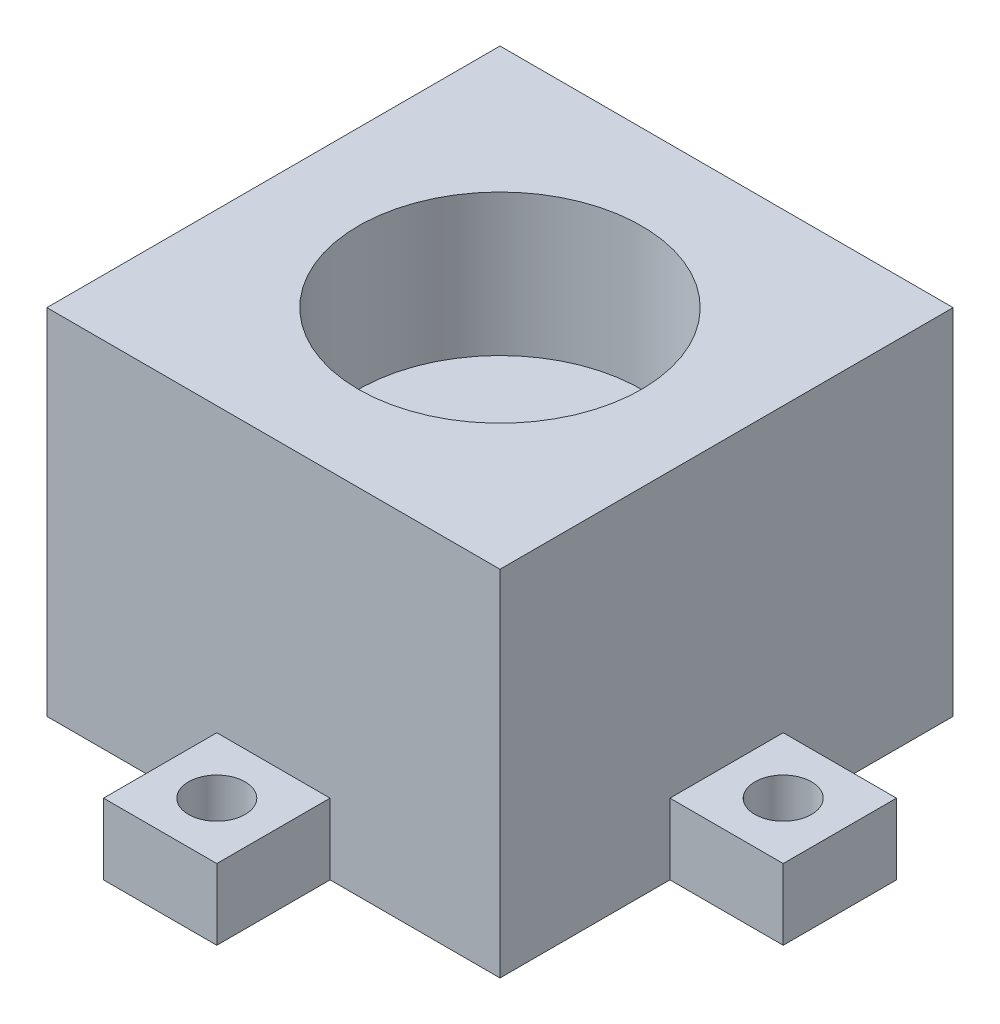
ISO-10303-21;
HEADER;
FILE_DESCRIPTION(('STEP AP214'),'2;1');
FILE_NAME('part.step','',(''),(''),'','','');
FILE_SCHEMA(('AUTOMOTIVE_DESIGN { 1 0 10303 214 1 1 1 1 }'));
ENDSEC;
DATA;
#1=APPLICATION_CONTEXT('core data for automotive mechanical design processes');
#2=APPLICATION_PROTOCOL_DEFINITION('international standard','automotive_design',2000,#1);
#3=PRODUCT_CONTEXT('',#1,'mechanical');
#4=PRODUCT('Part','Part','',(#3));
#5=PRODUCT_RELATED_PRODUCT_CATEGORY('part','',(#4));
#6=PRODUCT_DEFINITION_FORMATION('','',#4);
#7=PRODUCT_DEFINITION_CONTEXT('part definition',#1,'design');
#8=PRODUCT_DEFINITION('design','',#6,#7);
#9=PRODUCT_DEFINITION_SHAPE('','',#8);
#10=(LENGTH_UNIT() NAMED_UNIT(*) SI_UNIT(.MILLI.,.METRE.));
#11=(NAMED_UNIT(*) PLANE_ANGLE_UNIT() SI_UNIT($,.RADIAN.));
#12=(NAMED_UNIT(*) SI_UNIT($,.STERADIAN.) SOLID_ANGLE_UNIT());
#13=UNCERTAINTY_MEASURE_WITH_UNIT(LENGTH_MEASURE(1.E-05),#10,'distance_accuracy_value','');
#14=(GEOMETRIC_REPRESENTATION_CONTEXT(3) GLOBAL_UNCERTAINTY_ASSIGNED_CONTEXT((#13)) GLOBAL_UNIT_ASSIGNED_CONTEXT((#10,
#11,#12)) REPRESENTATION_CONTEXT('',''));
#15=CARTESIAN_POINT('',(0.,0.,0.));
#16=DIRECTION('',(0.,0.,1.));
#17=DIRECTION('',(1.,0.,0.));
#18=AXIS2_PLACEMENT_3D('',#15,#16,#17);
#19=CARTESIAN_POINT('',(0.,6.35,0.));
#20=DIRECTION('',(0.,1.,0.));
#21=DIRECTION('',(0.,0.,1.));
#22=AXIS2_PLACEMENT_3D('',#19,#20,#21);
#23=PLANE('',#22);
#24=DIRECTION('',(0.,0.,1.));
#25=VECTOR('',#24,1.);
#26=CARTESIAN_POINT('',(0.,6.35,-40.64));
#27=LINE('',#26,#25);
#28=CARTESIAN_POINT('',(0.,6.35,-25.4));
#29=VERTEX_POINT('',#28);
#30=CARTESIAN_POINT('',(0.,6.35,-15.24));
#31=VERTEX_POINT('',#30);
#32=EDGE_CURVE('E11',#29,#31,#27,.T.);
#33=ORIENTED_EDGE('',*,*,#32,.F.);
#34=DIRECTION('',(1.,0.,0.));
#35=VECTOR('',#34,1.);
#36=CARTESIAN_POINT('',(0.,6.35,-25.4));
#37=LINE('',#36,#35);
#38=CARTESIAN_POINT('',(-10.16,6.35,-25.4));
#39=VERTEX_POINT('',#38);
#40=EDGE_CURVE('E183',#39,#29,#37,.T.);
#41=ORIENTED_EDGE('',*,*,#40,.F.);
#42=DIRECTION('',(0.,0.,1.));
#43=VECTOR('',#42,1.);
#44=CARTESIAN_POINT('',(-10.16,6.35,0.));
#45=LINE('',#44,#43);
#46=CARTESIAN_POINT('',(-10.16,6.35,-15.24));
#47=VERTEX_POINT('',#46);
#48=EDGE_CURVE('E221',#39,#47,#45,.T.);
#49=ORIENTED_EDGE('',*,*,#48,.T.);
#50=DIRECTION('',(1.,0.,0.));
#51=VECTOR('',#50,1.);
#52=CARTESIAN_POINT('',(0.,6.35,-15.24));
#53=LINE('',#52,#51);
#54=EDGE_CURVE('E131',#47,#31,#53,.T.);
#55=ORIENTED_EDGE('',*,*,#54,.T.);
#56=EDGE_LOOP('',(#33,#41,#49,#55));
#57=FACE_BOUND('',#56,.T.);
#58=CARTESIAN_POINT('',(-5.08,6.35,-20.32));
#59=DIRECTION('',(0.,1.,0.));
#60=DIRECTION('',(0.,0.,1.));
#61=AXIS2_PLACEMENT_3D('',#58,#59,#60);
#62=CIRCLE('',#61,2.54);
#63=CARTESIAN_POINT('',(-5.08,6.35,-17.78));
#64=VERTEX_POINT('',#63);
#65=EDGE_CURVE('E207',#64,#64,#62,.T.);
#66=ORIENTED_EDGE('',*,*,#65,.F.);
#67=EDGE_LOOP('',(#66));
#68=FACE_BOUND('',#67,.T.);
#69=ADVANCED_FACE('F35',(#57,#68),#23,.T.);
#70=DIRECTION('',(-1.,0.,0.));
#71=VECTOR('',#70,1.);
#72=CARTESIAN_POINT('',(0.,6.35,-40.64));
#73=LINE('',#72,#71);
#74=CARTESIAN_POINT('',(25.4,6.35,-40.64));
#75=VERTEX_POINT('',#74);
#76=CARTESIAN_POINT('',(15.24,6.35,-40.64));
#77=VERTEX_POINT('',#76);
#78=EDGE_CURVE('E45',#75,#77,#73,.T.);
#79=ORIENTED_EDGE('',*,*,#78,.F.);
#80=DIRECTION('',(0.,0.,1.));
#81=VECTOR('',#80,1.);
#82=CARTESIAN_POINT('',(25.4,6.35,0.));
#83=LINE('',#82,#81);
#84=CARTESIAN_POINT('',(25.4,6.35,-50.8));
#85=VERTEX_POINT('',#84);
#86=EDGE_CURVE('E240',#85,#75,#83,.T.);
#87=ORIENTED_EDGE('',*,*,#86,.F.);
#88=DIRECTION('',(1.,0.,0.));
#89=VECTOR('',#88,1.);
#90=CARTESIAN_POINT('',(0.,6.35,-50.8));
#91=LINE('',#90,#89);
#92=CARTESIAN_POINT('',(15.24,6.35,-50.8));
#93=VERTEX_POINT('',#92);
#94=EDGE_CURVE('E181',#93,#85,#91,.T.);
#95=ORIENTED_EDGE('',*,*,#94,.F.);
#96=DIRECTION('',(0.,0.,1.));
#97=VECTOR('',#96,1.);
#98=CARTESIAN_POINT('',(15.24,6.35,0.));
#99=LINE('',#98,#97);
#100=EDGE_CURVE('E173',#93,#77,#99,.T.);
#101=ORIENTED_EDGE('',*,*,#100,.T.);
#102=EDGE_LOOP('',(#79,#87,#95,#101));
#103=FACE_BOUND('',#102,.T.);
#104=CARTESIAN_POINT('',(20.32,6.35,-45.72));
#105=DIRECTION('',(0.,1.,0.));
#106=DIRECTION('',(0.,0.,1.));
#107=AXIS2_PLACEMENT_3D('',#104,#105,#106);
#108=CIRCLE('',#107,2.54);
#109=CARTESIAN_POINT('',(20.32,6.35,-43.18));
#110=VERTEX_POINT('',#109);
#111=EDGE_CURVE('E211',#110,#110,#108,.T.);
#112=ORIENTED_EDGE('',*,*,#111,.F.);
#113=EDGE_LOOP('',(#112));
#114=FACE_BOUND('',#113,.T.);
#115=ADVANCED_FACE('F175',(#103,#114),#23,.T.);
#116=DIRECTION('',(0.,0.,-1.));
#117=VECTOR('',#116,1.);
#118=CARTESIAN_POINT('',(40.64,6.35,-40.64));
#119=LINE('',#118,#117);
#120=CARTESIAN_POINT('',(40.64,6.35,-15.24));
#121=VERTEX_POINT('',#120);
#122=CARTESIAN_POINT('',(40.64,6.35,-25.4));
#123=VERTEX_POINT('',#122);
#124=EDGE_CURVE('E200',#121,#123,#119,.T.);
#125=ORIENTED_EDGE('',*,*,#124,.F.);
#126=DIRECTION('',(1.,0.,0.));
#127=VECTOR('',#126,1.);
#128=CARTESIAN_POINT('',(0.,6.35,-15.24));
#129=LINE('',#128,#127);
#130=CARTESIAN_POINT('',(50.8,6.35,-15.24));
#131=VERTEX_POINT('',#130);
#132=EDGE_CURVE('E232',#121,#131,#129,.T.);
#133=ORIENTED_EDGE('',*,*,#132,.T.);
#134=DIRECTION('',(0.,0.,1.));
#135=VECTOR('',#134,1.);
#136=CARTESIAN_POINT('',(50.8,6.35,0.));
#137=LINE('',#136,#135);
#138=CARTESIAN_POINT('',(50.8,6.35,-25.4));
#139=VERTEX_POINT('',#138);
#140=EDGE_CURVE('E234',#139,#131,#137,.T.);
#141=ORIENTED_EDGE('',*,*,#140,.F.);
#142=DIRECTION('',(1.,0.,0.));
#143=VECTOR('',#142,1.);
#144=CARTESIAN_POINT('',(0.,6.35,-25.4));
#145=LINE('',#144,#143);
#146=EDGE_CURVE('E237',#123,#139,#145,.T.);
#147=ORIENTED_EDGE('',*,*,#146,.F.);
#148=EDGE_LOOP('',(#125,#133,#141,#147));
#149=FACE_BOUND('',#148,.T.);
#150=CARTESIAN_POINT('',(45.72,6.35,-20.32));
#151=DIRECTION('',(0.,1.,0.));
#152=DIRECTION('',(0.,0.,1.));
#153=AXIS2_PLACEMENT_3D('',#150,#151,#152);
#154=CIRCLE('',#153,2.54);
#155=CARTESIAN_POINT('',(45.72,6.35,-17.78));
#156=VERTEX_POINT('',#155);
#157=EDGE_CURVE('E214',#156,#156,#154,.T.);
#158=ORIENTED_EDGE('',*,*,#157,.F.);
#159=EDGE_LOOP('',(#158));
#160=FACE_BOUND('',#159,.T.);
#161=ADVANCED_FACE('F362',(#149,#160),#23,.T.);
#162=CARTESIAN_POINT('',(-10.16,6.35,0.));
#163=DIRECTION('',(1.,0.,0.));
#164=DIRECTION('',(0.,0.,-1.));
#165=AXIS2_PLACEMENT_3D('',#162,#163,#164);
#166=PLANE('',#165);
#167=DIRECTION('',(0.,0.,1.));
#168=VECTOR('',#167,1.);
#169=CARTESIAN_POINT('',(-10.16,0.,0.));
#170=LINE('',#169,#168);
#171=CARTESIAN_POINT('',(-10.16,0.,-25.4));
#172=VERTEX_POINT('',#171);
#173=CARTESIAN_POINT('',(-10.16,0.,-15.24));
#174=VERTEX_POINT('',#173);
#175=EDGE_CURVE('E244',#172,#174,#170,.T.);
#176=ORIENTED_EDGE('',*,*,#175,.T.);
#177=DIRECTION('',(0.,-1.,0.));
#178=VECTOR('',#177,1.);
#179=CARTESIAN_POINT('',(-10.16,6.35,-15.24));
#180=LINE('',#179,#178);
#181=EDGE_CURVE('E324',#47,#174,#180,.T.);
#182=ORIENTED_EDGE('',*,*,#181,.F.);
#183=ORIENTED_EDGE('',*,*,#48,.F.);
#184=DIRECTION('',(0.,-1.,0.));
#185=VECTOR('',#184,1.);
#186=CARTESIAN_POINT('',(-10.16,6.35,-25.4));
#187=LINE('',#186,#185);
#188=EDGE_CURVE('E54',#39,#172,#187,.T.);
#189=ORIENTED_EDGE('',*,*,#188,.T.);
#190=EDGE_LOOP('',(#176,#182,#183,#189));
#191=FACE_BOUND('',#190,.T.);
#192=ADVANCED_FACE('F37',(#191),#166,.F.);
#193=CARTESIAN_POINT('',(0.,6.35,-15.24));
#194=DIRECTION('',(0.,0.,-1.));
#195=DIRECTION('',(-1.,0.,0.));
#196=AXIS2_PLACEMENT_3D('',#193,#194,#195);
#197=PLANE('',#196);
#198=DIRECTION('',(1.,0.,0.));
#199=VECTOR('',#198,1.);
#200=CARTESIAN_POINT('',(0.,0.,-15.24));
#201=LINE('',#200,#199);
#202=CARTESIAN_POINT('',(0.,0.,-15.24));
#203=VERTEX_POINT('',#202);
#204=EDGE_CURVE('E246',#174,#203,#201,.T.);
#205=ORIENTED_EDGE('',*,*,#204,.T.);
#206=DIRECTION('',(0.,-1.,0.));
#207=VECTOR('',#206,1.);
#208=CARTESIAN_POINT('',(0.,6.35,-15.24));
#209=LINE('',#208,#207);
#210=EDGE_CURVE('E322',#31,#203,#209,.T.);
#211=ORIENTED_EDGE('',*,*,#210,.F.);
#212=ORIENTED_EDGE('',*,*,#54,.F.);
#213=ORIENTED_EDGE('',*,*,#181,.T.);
#214=EDGE_LOOP('',(#205,#211,#212,#213));
#215=FACE_BOUND('',#214,.T.);
#216=ADVANCED_FACE('F382',(#215),#197,.F.);
#217=CARTESIAN_POINT('',(15.24,6.35,0.));
#218=DIRECTION('',(-1.,0.,0.));
#219=DIRECTION('',(0.,0.,1.));
#220=AXIS2_PLACEMENT_3D('',#217,#218,#219);
#221=PLANE('',#220);
#222=DIRECTION('',(0.,0.,-1.));
#223=VECTOR('',#222,1.);
#224=CARTESIAN_POINT('',(15.24,0.,0.));
#225=LINE('',#224,#223);
#226=CARTESIAN_POINT('',(15.24,0.,10.16));
#227=VERTEX_POINT('',#226);
#228=CARTESIAN_POINT('',(15.24,0.,0.));
#229=VERTEX_POINT('',#228);
#230=EDGE_CURVE('E256',#227,#229,#225,.T.);
#231=ORIENTED_EDGE('',*,*,#230,.F.);
#232=DIRECTION('',(0.,-1.,0.));
#233=VECTOR('',#232,1.);
#234=CARTESIAN_POINT('',(15.24,6.35,10.16));
#235=LINE('',#234,#233);
#236=CARTESIAN_POINT('',(15.24,6.35,10.16));
#237=VERTEX_POINT('',#236);
#238=EDGE_CURVE('E316',#237,#227,#235,.T.);
#239=ORIENTED_EDGE('',*,*,#238,.F.);
#240=DIRECTION('',(0.,0.,-1.));
#241=VECTOR('',#240,1.);
#242=CARTESIAN_POINT('',(15.24,6.35,0.));
#243=LINE('',#242,#241);
#244=CARTESIAN_POINT('',(15.24,6.35,0.));
#245=VERTEX_POINT('',#244);
#246=EDGE_CURVE('E225',#237,#245,#243,.T.);
#247=ORIENTED_EDGE('',*,*,#246,.T.);
#248=DIRECTION('',(0.,-1.,0.));
#249=VECTOR('',#248,1.);
#250=CARTESIAN_POINT('',(15.24,6.35,0.));
#251=LINE('',#250,#249);
#252=EDGE_CURVE('E318',#245,#229,#251,.T.);
#253=ORIENTED_EDGE('',*,*,#252,.T.);
#254=EDGE_LOOP('',(#231,#239,#247,#253));
#255=FACE_BOUND('',#254,.T.);
#256=ADVANCED_FACE('F490',(#255),#221,.T.);
#257=CARTESIAN_POINT('',(0.,6.35,10.16));
#258=DIRECTION('',(0.,0.,-1.));
#259=DIRECTION('',(-1.,0.,0.));
#260=AXIS2_PLACEMENT_3D('',#257,#258,#259);
#261=PLANE('',#260);
#262=DIRECTION('',(1.,0.,0.));
#263=VECTOR('',#262,1.);
#264=CARTESIAN_POINT('',(0.,0.,10.16));
#265=LINE('',#264,#263);
#266=CARTESIAN_POINT('',(25.4,0.,10.16));
#267=VERTEX_POINT('',#266);
#268=EDGE_CURVE('E260',#227,#267,#265,.T.);
#269=ORIENTED_EDGE('',*,*,#268,.T.);
#270=DIRECTION('',(0.,-1.,0.));
#271=VECTOR('',#270,1.);
#272=CARTESIAN_POINT('',(25.4,6.35,10.16));
#273=LINE('',#272,#271);
#274=CARTESIAN_POINT('',(25.4,6.35,10.16));
#275=VERTEX_POINT('',#274);
#276=EDGE_CURVE('E313',#275,#267,#273,.T.);
#277=ORIENTED_EDGE('',*,*,#276,.F.);
#278=DIRECTION('',(1.,0.,0.));
#279=VECTOR('',#278,1.);
#280=CARTESIAN_POINT('',(0.,6.35,10.16));
#281=LINE('',#280,#279);
#282=EDGE_CURVE('E228',#237,#275,#281,.T.);
#283=ORIENTED_EDGE('',*,*,#282,.F.);
#284=ORIENTED_EDGE('',*,*,#238,.T.);
#285=EDGE_LOOP('',(#269,#277,#283,#284));
#286=FACE_BOUND('',#285,.T.);
#287=ADVANCED_FACE('F487',(#286),#261,.F.);
#288=CARTESIAN_POINT('',(25.4,6.35,0.));
#289=DIRECTION('',(-1.,0.,0.));
#290=DIRECTION('',(0.,0.,1.));
#291=AXIS2_PLACEMENT_3D('',#288,#289,#290);
#292=PLANE('',#291);
#293=DIRECTION('',(0.,0.,-1.));
#294=VECTOR('',#293,1.);
#295=CARTESIAN_POINT('',(25.4,0.,0.));
#296=LINE('',#295,#294);
#297=CARTESIAN_POINT('',(25.4,0.,0.));
#298=VERTEX_POINT('',#297);
#299=EDGE_CURVE('E262',#267,#298,#296,.T.);
#300=ORIENTED_EDGE('',*,*,#299,.T.);
#301=DIRECTION('',(0.,-1.,0.));
#302=VECTOR('',#301,1.);
#303=CARTESIAN_POINT('',(25.4,6.35,0.));
#304=LINE('',#303,#302);
#305=CARTESIAN_POINT('',(25.4,6.35,0.));
#306=VERTEX_POINT('',#305);
#307=EDGE_CURVE('E310',#306,#298,#304,.T.);
#308=ORIENTED_EDGE('',*,*,#307,.F.);
#309=DIRECTION('',(0.,0.,-1.));
#310=VECTOR('',#309,1.);
#311=CARTESIAN_POINT('',(25.4,6.35,0.));
#312=LINE('',#311,#310);
#313=EDGE_CURVE('E230',#275,#306,#312,.T.);
#314=ORIENTED_EDGE('',*,*,#313,.F.);
#315=ORIENTED_EDGE('',*,*,#276,.T.);
#316=EDGE_LOOP('',(#300,#308,#314,#315));
#317=FACE_BOUND('',#316,.T.);
#318=ADVANCED_FACE('F439',(#317),#292,.F.);
#319=CARTESIAN_POINT('',(0.,6.35,0.));
#320=DIRECTION('',(0.,0.,-1.));
#321=DIRECTION('',(-1.,0.,0.));
#322=AXIS2_PLACEMENT_3D('',#319,#320,#321);
#323=PLANE('',#322);
#324=DIRECTION('',(1.,0.,0.));
#325=VECTOR('',#324,1.);
#326=CARTESIAN_POINT('',(0.,0.,0.));
#327=LINE('',#326,#325);
#328=CARTESIAN_POINT('',(40.64,0.,0.));
#329=VERTEX_POINT('',#328);
#330=EDGE_CURVE('E257',#298,#329,#327,.T.);
#331=ORIENTED_EDGE('',*,*,#330,.T.);
#332=DIRECTION('',(0.,-1.,0.));
#333=VECTOR('',#332,1.);
#334=CARTESIAN_POINT('',(40.64,6.35,0.));
#335=LINE('',#334,#333);
#336=CARTESIAN_POINT('',(40.64,31.75,0.));
#337=VERTEX_POINT('',#336);
#338=EDGE_CURVE('E307',#337,#329,#335,.T.);
#339=ORIENTED_EDGE('',*,*,#338,.F.);
#340=DIRECTION('',(1.,0.,0.));
#341=VECTOR('',#340,1.);
#342=CARTESIAN_POINT('',(0.,31.75,0.));
#343=LINE('',#342,#341);
#344=CARTESIAN_POINT('',(0.,31.75,0.));
#345=VERTEX_POINT('',#344);
#346=EDGE_CURVE('E419',#345,#337,#343,.T.);
#347=ORIENTED_EDGE('',*,*,#346,.F.);
#348=DIRECTION('',(0.,-1.,0.));
#349=VECTOR('',#348,1.);
#350=CARTESIAN_POINT('',(0.,6.35,0.));
#351=LINE('',#350,#349);
#352=CARTESIAN_POINT('',(0.,0.,0.));
#353=VERTEX_POINT('',#352);
#354=EDGE_CURVE('E320',#345,#353,#351,.T.);
#355=ORIENTED_EDGE('',*,*,#354,.T.);
#356=EDGE_CURVE('E252',#353,#229,#327,.T.);
#357=ORIENTED_EDGE('',*,*,#356,.T.);
#358=ORIENTED_EDGE('',*,*,#252,.F.);
#359=DIRECTION('',(1.,0.,0.));
#360=VECTOR('',#359,1.);
#361=CARTESIAN_POINT('',(0.,6.35,0.));
#362=LINE('',#361,#360);
#363=EDGE_CURVE('E203',#245,#306,#362,.T.);
#364=ORIENTED_EDGE('',*,*,#363,.T.);
#365=ORIENTED_EDGE('',*,*,#307,.T.);
#366=EDGE_LOOP('',(#331,#339,#347,#355,#357,#358,#364,#365));
#367=FACE_BOUND('',#366,.T.);
#368=ADVANCED_FACE('F431',(#367),#323,.F.);
#369=CARTESIAN_POINT('',(0.,6.35,-15.24));
#370=DIRECTION('',(0.,0.,-1.));
#371=DIRECTION('',(-1.,0.,0.));
#372=AXIS2_PLACEMENT_3D('',#369,#370,#371);
#373=PLANE('',#372);
#374=DIRECTION('',(1.,0.,0.));
#375=VECTOR('',#374,1.);
#376=CARTESIAN_POINT('',(0.,0.,-15.24));
#377=LINE('',#376,#375);
#378=CARTESIAN_POINT('',(40.64,0.,-15.24));
#379=VERTEX_POINT('',#378);
#380=CARTESIAN_POINT('',(50.8,0.,-15.24));
#381=VERTEX_POINT('',#380);
#382=EDGE_CURVE('E266',#379,#381,#377,.T.);
#383=ORIENTED_EDGE('',*,*,#382,.T.);
#384=DIRECTION('',(0.,-1.,0.));
#385=VECTOR('',#384,1.);
#386=CARTESIAN_POINT('',(50.8,6.35,-15.24));
#387=LINE('',#386,#385);
#388=EDGE_CURVE('E302',#131,#381,#387,.T.);
#389=ORIENTED_EDGE('',*,*,#388,.F.);
#390=ORIENTED_EDGE('',*,*,#132,.F.);
#391=DIRECTION('',(0.,-1.,0.));
#392=VECTOR('',#391,1.);
#393=CARTESIAN_POINT('',(40.64,6.35,-15.24));
#394=LINE('',#393,#392);
#395=EDGE_CURVE('E304',#121,#379,#394,.T.);
#396=ORIENTED_EDGE('',*,*,#395,.T.);
#397=EDGE_LOOP('',(#383,#389,#390,#396));
#398=FACE_BOUND('',#397,.T.);
#399=ADVANCED_FACE('F478',(#398),#373,.F.);
#400=CARTESIAN_POINT('',(50.8,6.35,0.));
#401=DIRECTION('',(1.,0.,0.));
#402=DIRECTION('',(0.,0.,-1.));
#403=AXIS2_PLACEMENT_3D('',#400,#401,#402);
#404=PLANE('',#403);
#405=DIRECTION('',(0.,0.,1.));
#406=VECTOR('',#405,1.);
#407=CARTESIAN_POINT('',(50.8,0.,0.));
#408=LINE('',#407,#406);
#409=CARTESIAN_POINT('',(50.8,0.,-25.4));
#410=VERTEX_POINT('',#409);
#411=EDGE_CURVE('E270',#410,#381,#408,.T.);
#412=ORIENTED_EDGE('',*,*,#411,.F.);
#413=DIRECTION('',(0.,-1.,0.));
#414=VECTOR('',#413,1.);
#415=CARTESIAN_POINT('',(50.8,6.35,-25.4));
#416=LINE('',#415,#414);
#417=EDGE_CURVE('E300',#139,#410,#416,.T.);
#418=ORIENTED_EDGE('',*,*,#417,.F.);
#419=ORIENTED_EDGE('',*,*,#140,.T.);
#420=ORIENTED_EDGE('',*,*,#388,.T.);
#421=EDGE_LOOP('',(#412,#418,#419,#420));
#422=FACE_BOUND('',#421,.T.);
#423=ADVANCED_FACE('F474',(#422),#404,.T.);
#424=CARTESIAN_POINT('',(0.,6.35,-25.4));
#425=DIRECTION('',(0.,0.,-1.));
#426=DIRECTION('',(-1.,0.,0.));
#427=AXIS2_PLACEMENT_3D('',#424,#425,#426);
#428=PLANE('',#427);
#429=DIRECTION('',(1.,0.,0.));
#430=VECTOR('',#429,1.);
#431=CARTESIAN_POINT('',(0.,0.,-25.4));
#432=LINE('',#431,#430);
#433=CARTESIAN_POINT('',(40.64,0.,-25.4));
#434=VERTEX_POINT('',#433);
#435=EDGE_CURVE('E273',#434,#410,#432,.T.);
#436=ORIENTED_EDGE('',*,*,#435,.F.);
#437=DIRECTION('',(0.,-1.,0.));
#438=VECTOR('',#437,1.);
#439=CARTESIAN_POINT('',(40.64,6.35,-25.4));
#440=LINE('',#439,#438);
#441=EDGE_CURVE('E298',#123,#434,#440,.T.);
#442=ORIENTED_EDGE('',*,*,#441,.F.);
#443=ORIENTED_EDGE('',*,*,#146,.T.);
#444=ORIENTED_EDGE('',*,*,#417,.T.);
#445=EDGE_LOOP('',(#436,#442,#443,#444));
#446=FACE_BOUND('',#445,.T.);
#447=ADVANCED_FACE('F471',(#446),#428,.T.);
#448=CARTESIAN_POINT('',(40.64,6.35,0.));
#449=DIRECTION('',(-1.,0.,0.));
#450=DIRECTION('',(0.,0.,1.));
#451=AXIS2_PLACEMENT_3D('',#448,#449,#450);
#452=PLANE('',#451);
#453=DIRECTION('',(0.,0.,-1.));
#454=VECTOR('',#453,1.);
#455=CARTESIAN_POINT('',(40.64,0.,0.));
#456=LINE('',#455,#454);
#457=CARTESIAN_POINT('',(40.64,0.,-40.64));
#458=VERTEX_POINT('',#457);
#459=EDGE_CURVE('E267',#434,#458,#456,.T.);
#460=ORIENTED_EDGE('',*,*,#459,.T.);
#461=DIRECTION('',(0.,-1.,0.));
#462=VECTOR('',#461,1.);
#463=CARTESIAN_POINT('',(40.64,6.35,-40.64));
#464=LINE('',#463,#462);
#465=CARTESIAN_POINT('',(40.64,31.75,-40.64));
#466=VERTEX_POINT('',#465);
#467=EDGE_CURVE('E296',#466,#458,#464,.T.);
#468=ORIENTED_EDGE('',*,*,#467,.F.);
#469=DIRECTION('',(0.,0.,-1.));
#470=VECTOR('',#469,1.);
#471=CARTESIAN_POINT('',(40.64,31.75,-40.64));
#472=LINE('',#471,#470);
#473=EDGE_CURVE('E417',#337,#466,#472,.T.);
#474=ORIENTED_EDGE('',*,*,#473,.F.);
#475=ORIENTED_EDGE('',*,*,#338,.T.);
#476=EDGE_CURVE('E264',#329,#379,#456,.T.);
#477=ORIENTED_EDGE('',*,*,#476,.T.);
#478=ORIENTED_EDGE('',*,*,#395,.F.);
#479=ORIENTED_EDGE('',*,*,#124,.T.);
#480=ORIENTED_EDGE('',*,*,#441,.T.);
#481=EDGE_LOOP('',(#460,#468,#474,#475,#477,#478,#479,#480));
#482=FACE_BOUND('',#481,.T.);
#483=ADVANCED_FACE('F449',(#482),#452,.F.);
#484=CARTESIAN_POINT('',(25.4,6.35,0.));
#485=DIRECTION('',(1.,0.,0.));
#486=DIRECTION('',(0.,0.,-1.));
#487=AXIS2_PLACEMENT_3D('',#484,#485,#486);
#488=PLANE('',#487);
#489=DIRECTION('',(0.,0.,1.));
#490=VECTOR('',#489,1.);
#491=CARTESIAN_POINT('',(25.4,0.,0.));
#492=LINE('',#491,#490);
#493=CARTESIAN_POINT('',(25.4,0.,-50.8));
#494=VERTEX_POINT('',#493);
#495=CARTESIAN_POINT('',(25.4,0.,-40.64));
#496=VERTEX_POINT('',#495);
#497=EDGE_CURVE('E279',#494,#496,#492,.T.);
#498=ORIENTED_EDGE('',*,*,#497,.F.);
#499=DIRECTION('',(0.,-1.,0.));
#500=VECTOR('',#499,1.);
#501=CARTESIAN_POINT('',(25.4,6.35,-50.8));
#502=LINE('',#501,#500);
#503=EDGE_CURVE('E293',#85,#494,#502,.T.);
#504=ORIENTED_EDGE('',*,*,#503,.F.);
#505=ORIENTED_EDGE('',*,*,#86,.T.);
#506=DIRECTION('',(0.,-1.,0.));
#507=VECTOR('',#506,1.);
#508=CARTESIAN_POINT('',(25.4,6.35,-40.64));
#509=LINE('',#508,#507);
#510=EDGE_CURVE('E198',#75,#496,#509,.T.);
#511=ORIENTED_EDGE('',*,*,#510,.T.);
#512=EDGE_LOOP('',(#498,#504,#505,#511));
#513=FACE_BOUND('',#512,.T.);
#514=ADVANCED_FACE('F456',(#513),#488,.T.);
#515=CARTESIAN_POINT('',(0.,6.35,-50.8));
#516=DIRECTION('',(0.,0.,-1.));
#517=DIRECTION('',(-1.,0.,0.));
#518=AXIS2_PLACEMENT_3D('',#515,#516,#517);
#519=PLANE('',#518);
#520=DIRECTION('',(1.,0.,0.));
#521=VECTOR('',#520,1.);
#522=CARTESIAN_POINT('',(0.,0.,-50.8));
#523=LINE('',#522,#521);
#524=CARTESIAN_POINT('',(15.24,0.,-50.8));
#525=VERTEX_POINT('',#524);
#526=EDGE_CURVE('E283',#525,#494,#523,.T.);
#527=ORIENTED_EDGE('',*,*,#526,.F.);
#528=DIRECTION('',(0.,-1.,0.));
#529=VECTOR('',#528,1.);
#530=CARTESIAN_POINT('',(15.24,6.35,-50.8));
#531=LINE('',#530,#529);
#532=EDGE_CURVE('E193',#93,#525,#531,.T.);
#533=ORIENTED_EDGE('',*,*,#532,.F.);
#534=ORIENTED_EDGE('',*,*,#94,.T.);
#535=ORIENTED_EDGE('',*,*,#503,.T.);
#536=EDGE_LOOP('',(#527,#533,#534,#535));
#537=FACE_BOUND('',#536,.T.);
#538=ADVANCED_FACE('F458',(#537),#519,.T.);
#539=CARTESIAN_POINT('',(15.24,6.35,0.));
#540=DIRECTION('',(1.,0.,0.));
#541=DIRECTION('',(0.,0.,-1.));
#542=AXIS2_PLACEMENT_3D('',#539,#540,#541);
#543=PLANE('',#542);
#544=DIRECTION('',(0.,0.,1.));
#545=VECTOR('',#544,1.);
#546=CARTESIAN_POINT('',(15.24,0.,0.));
#547=LINE('',#546,#545);
#548=CARTESIAN_POINT('',(15.24,0.,-40.64));
#549=VERTEX_POINT('',#548);
#550=EDGE_CURVE('E189',#525,#549,#547,.T.);
#551=ORIENTED_EDGE('',*,*,#550,.T.);
#552=DIRECTION('',(0.,-1.,0.));
#553=VECTOR('',#552,1.);
#554=CARTESIAN_POINT('',(15.24,6.35,-40.64));
#555=LINE('',#554,#553);
#556=EDGE_CURVE('E186',#77,#549,#555,.T.);
#557=ORIENTED_EDGE('',*,*,#556,.F.);
#558=ORIENTED_EDGE('',*,*,#100,.F.);
#559=ORIENTED_EDGE('',*,*,#532,.T.);
#560=EDGE_LOOP('',(#551,#557,#558,#559));
#561=FACE_BOUND('',#560,.T.);
#562=ADVANCED_FACE('F187',(#561),#543,.F.);
#563=CARTESIAN_POINT('',(0.,6.35,-40.64));
#564=DIRECTION('',(0.,0.,-1.));
#565=DIRECTION('',(-1.,0.,0.));
#566=AXIS2_PLACEMENT_3D('',#563,#564,#565);
#567=PLANE('',#566);
#568=DIRECTION('',(1.,0.,0.));
#569=VECTOR('',#568,1.);
#570=CARTESIAN_POINT('',(0.,0.,-40.64));
#571=LINE('',#570,#569);
#572=CARTESIAN_POINT('',(0.,0.,-40.64));
#573=VERTEX_POINT('',#572);
#574=EDGE_CURVE('E280',#573,#549,#571,.T.);
#575=ORIENTED_EDGE('',*,*,#574,.F.);
#576=DIRECTION('',(0.,-1.,0.));
#577=VECTOR('',#576,1.);
#578=CARTESIAN_POINT('',(0.,6.35,-40.64));
#579=LINE('',#578,#577);
#580=CARTESIAN_POINT('',(0.,31.75,-40.64));
#581=VERTEX_POINT('',#580);
#582=EDGE_CURVE('E194',#581,#573,#579,.T.);
#583=ORIENTED_EDGE('',*,*,#582,.F.);
#584=DIRECTION('',(-1.,0.,0.));
#585=VECTOR('',#584,1.);
#586=CARTESIAN_POINT('',(0.,31.75,-40.64));
#587=LINE('',#586,#585);
#588=EDGE_CURVE('E220',#466,#581,#587,.T.);
#589=ORIENTED_EDGE('',*,*,#588,.F.);
#590=ORIENTED_EDGE('',*,*,#467,.T.);
#591=EDGE_CURVE('E276',#496,#458,#571,.T.);
#592=ORIENTED_EDGE('',*,*,#591,.F.);
#593=ORIENTED_EDGE('',*,*,#510,.F.);
#594=ORIENTED_EDGE('',*,*,#78,.T.);
#595=ORIENTED_EDGE('',*,*,#556,.T.);
#596=EDGE_LOOP('',(#575,#583,#589,#590,#592,#593,#594,#595));
#597=FACE_BOUND('',#596,.T.);
#598=ADVANCED_FACE('F196',(#597),#567,.T.);
#599=CARTESIAN_POINT('',(0.,6.35,0.));
#600=DIRECTION('',(-1.,0.,0.));
#601=DIRECTION('',(0.,0.,1.));
#602=AXIS2_PLACEMENT_3D('',#599,#600,#601);
#603=PLANE('',#602);
#604=DIRECTION('',(0.,0.,-1.));
#605=VECTOR('',#604,1.);
#606=CARTESIAN_POINT('',(0.,0.,0.));
#607=LINE('',#606,#605);
#608=CARTESIAN_POINT('',(0.,0.,-25.4));
#609=VERTEX_POINT('',#608);
#610=EDGE_CURVE('E253',#609,#573,#607,.T.);
#611=ORIENTED_EDGE('',*,*,#610,.F.);
#612=DIRECTION('',(0.,-1.,0.));
#613=VECTOR('',#612,1.);
#614=CARTESIAN_POINT('',(0.,6.35,-25.4));
#615=LINE('',#614,#613);
#616=EDGE_CURVE('E118',#29,#609,#615,.T.);
#617=ORIENTED_EDGE('',*,*,#616,.F.);
#618=ORIENTED_EDGE('',*,*,#32,.T.);
#619=ORIENTED_EDGE('',*,*,#210,.T.);
#620=EDGE_CURVE('E249',#353,#203,#607,.T.);
#621=ORIENTED_EDGE('',*,*,#620,.F.);
#622=ORIENTED_EDGE('',*,*,#354,.F.);
#623=DIRECTION('',(0.,0.,1.));
#624=VECTOR('',#623,1.);
#625=CARTESIAN_POINT('',(0.,31.75,-40.64));
#626=LINE('',#625,#624);
#627=EDGE_CURVE('E415',#581,#345,#626,.T.);
#628=ORIENTED_EDGE('',*,*,#627,.F.);
#629=ORIENTED_EDGE('',*,*,#582,.T.);
#630=EDGE_LOOP('',(#611,#617,#618,#619,#621,#622,#628,#629));
#631=FACE_BOUND('',#630,.T.);
#632=ADVANCED_FACE('F374',(#631),#603,.T.);
#633=CARTESIAN_POINT('',(0.,6.35,-25.4));
#634=DIRECTION('',(0.,0.,-1.));
#635=DIRECTION('',(-1.,0.,0.));
#636=AXIS2_PLACEMENT_3D('',#633,#634,#635);
#637=PLANE('',#636);
#638=DIRECTION('',(1.,0.,0.));
#639=VECTOR('',#638,1.);
#640=CARTESIAN_POINT('',(0.,0.,-25.4));
#641=LINE('',#640,#639);
#642=EDGE_CURVE('E223',#172,#609,#641,.T.);
#643=ORIENTED_EDGE('',*,*,#642,.F.);
#644=ORIENTED_EDGE('',*,*,#188,.F.);
#645=ORIENTED_EDGE('',*,*,#40,.T.);
#646=ORIENTED_EDGE('',*,*,#616,.T.);
#647=EDGE_LOOP('',(#643,#644,#645,#646));
#648=FACE_BOUND('',#647,.T.);
#649=ADVANCED_FACE('F367',(#648),#637,.T.);
#650=ORIENTED_EDGE('',*,*,#363,.F.);
#651=ORIENTED_EDGE('',*,*,#246,.F.);
#652=ORIENTED_EDGE('',*,*,#282,.T.);
#653=ORIENTED_EDGE('',*,*,#313,.T.);
#654=EDGE_LOOP('',(#650,#651,#652,#653));
#655=FACE_BOUND('',#654,.T.);
#656=CARTESIAN_POINT('',(20.32,6.35,5.08));
#657=DIRECTION('',(0.,1.,0.));
#658=DIRECTION('',(0.,0.,1.));
#659=AXIS2_PLACEMENT_3D('',#656,#657,#658);
#660=CIRCLE('',#659,2.54);
#661=CARTESIAN_POINT('',(20.32,6.35,7.62));
#662=VERTEX_POINT('',#661);
#663=EDGE_CURVE('E217',#662,#662,#660,.T.);
#664=ORIENTED_EDGE('',*,*,#663,.F.);
#665=EDGE_LOOP('',(#664));
#666=FACE_BOUND('',#665,.T.);
#667=ADVANCED_FACE('F358',(#655,#666),#23,.T.);
#668=CARTESIAN_POINT('',(0.,0.,0.));
#669=DIRECTION('',(0.,1.,0.));
#670=DIRECTION('',(0.,0.,1.));
#671=AXIS2_PLACEMENT_3D('',#668,#669,#670);
#672=PLANE('',#671);
#673=CARTESIAN_POINT('',(-5.08,0.,-20.32));
#674=DIRECTION('',(0.,1.,0.));
#675=DIRECTION('',(0.,0.,1.));
#676=AXIS2_PLACEMENT_3D('',#673,#674,#675);
#677=CIRCLE('',#676,2.54);
#678=CARTESIAN_POINT('',(-5.08,0.,-17.78));
#679=VERTEX_POINT('',#678);
#680=EDGE_CURVE('E39',#679,#679,#677,.T.);
#681=ORIENTED_EDGE('',*,*,#680,.T.);
#682=EDGE_LOOP('',(#681));
#683=FACE_BOUND('',#682,.T.);
#684=CARTESIAN_POINT('',(20.32,0.,-45.72));
#685=DIRECTION('',(0.,1.,0.));
#686=DIRECTION('',(0.,0.,1.));
#687=AXIS2_PLACEMENT_3D('',#684,#685,#686);
#688=CIRCLE('',#687,2.54);
#689=CARTESIAN_POINT('',(20.32,0.,-43.18));
#690=VERTEX_POINT('',#689);
#691=EDGE_CURVE('E330',#690,#690,#688,.T.);
#692=ORIENTED_EDGE('',*,*,#691,.T.);
#693=EDGE_LOOP('',(#692));
#694=FACE_BOUND('',#693,.T.);
#695=CARTESIAN_POINT('',(45.72,0.,-20.32));
#696=DIRECTION('',(0.,1.,0.));
#697=DIRECTION('',(0.,0.,1.));
#698=AXIS2_PLACEMENT_3D('',#695,#696,#697);
#699=CIRCLE('',#698,2.54);
#700=CARTESIAN_POINT('',(45.72,0.,-17.78));
#701=VERTEX_POINT('',#700);
#702=EDGE_CURVE('E328',#701,#701,#699,.T.);
#703=ORIENTED_EDGE('',*,*,#702,.T.);
#704=EDGE_LOOP('',(#703));
#705=FACE_BOUND('',#704,.T.);
#706=CARTESIAN_POINT('',(20.32,0.,5.08));
#707=DIRECTION('',(0.,1.,0.));
#708=DIRECTION('',(0.,0.,1.));
#709=AXIS2_PLACEMENT_3D('',#706,#707,#708);
#710=CIRCLE('',#709,2.54);
#711=CARTESIAN_POINT('',(20.32,0.,7.62));
#712=VERTEX_POINT('',#711);
#713=EDGE_CURVE('E210',#712,#712,#710,.T.);
#714=ORIENTED_EDGE('',*,*,#713,.T.);
#715=EDGE_LOOP('',(#714));
#716=FACE_BOUND('',#715,.T.);
#717=ORIENTED_EDGE('',*,*,#175,.F.);
#718=ORIENTED_EDGE('',*,*,#642,.T.);
#719=ORIENTED_EDGE('',*,*,#610,.T.);
#720=ORIENTED_EDGE('',*,*,#574,.T.);
#721=ORIENTED_EDGE('',*,*,#550,.F.);
#722=ORIENTED_EDGE('',*,*,#526,.T.);
#723=ORIENTED_EDGE('',*,*,#497,.T.);
#724=ORIENTED_EDGE('',*,*,#591,.T.);
#725=ORIENTED_EDGE('',*,*,#459,.F.);
#726=ORIENTED_EDGE('',*,*,#435,.T.);
#727=ORIENTED_EDGE('',*,*,#411,.T.);
#728=ORIENTED_EDGE('',*,*,#382,.F.);
#729=ORIENTED_EDGE('',*,*,#476,.F.);
#730=ORIENTED_EDGE('',*,*,#330,.F.);
#731=ORIENTED_EDGE('',*,*,#299,.F.);
#732=ORIENTED_EDGE('',*,*,#268,.F.);
#733=ORIENTED_EDGE('',*,*,#230,.T.);
#734=ORIENTED_EDGE('',*,*,#356,.F.);
#735=ORIENTED_EDGE('',*,*,#620,.T.);
#736=ORIENTED_EDGE('',*,*,#204,.F.);
#737=EDGE_LOOP('',(#717,#718,#719,#720,#721,#722,#723,#724,#725,#726,#727,#728,#729,#730,#731,
#732,#733,#734,#735,#736));
#738=FACE_BOUND('',#737,.T.);
#739=ADVANCED_FACE('F337',(#683,#694,#705,#716,#738),#672,.F.);
#740=CARTESIAN_POINT('',(20.32,-2.54,5.08));
#741=DIRECTION('',(0.,1.,0.));
#742=DIRECTION('',(0.,0.,1.));
#743=AXIS2_PLACEMENT_3D('',#740,#741,#742);
#744=CYLINDRICAL_SURFACE('',#743,2.54);
#745=ORIENTED_EDGE('',*,*,#663,.T.);
#746=EDGE_LOOP('',(#745));
#747=FACE_BOUND('',#746,.T.);
#748=ORIENTED_EDGE('',*,*,#713,.F.);
#749=EDGE_LOOP('',(#748));
#750=FACE_BOUND('',#749,.T.);
#751=ADVANCED_FACE('F373',(#747,#750),#744,.F.);
#752=CARTESIAN_POINT('',(45.72,-2.54,-20.32));
#753=DIRECTION('',(0.,1.,0.));
#754=DIRECTION('',(0.,0.,1.));
#755=AXIS2_PLACEMENT_3D('',#752,#753,#754);
#756=CYLINDRICAL_SURFACE('',#755,2.54);
#757=ORIENTED_EDGE('',*,*,#157,.T.);
#758=EDGE_LOOP('',(#757));
#759=FACE_BOUND('',#758,.T.);
#760=ORIENTED_EDGE('',*,*,#702,.F.);
#761=EDGE_LOOP('',(#760));
#762=FACE_BOUND('',#761,.T.);
#763=ADVANCED_FACE('F352',(#759,#762),#756,.F.);
#764=CARTESIAN_POINT('',(20.32,-2.54,-45.72));
#765=DIRECTION('',(0.,1.,0.));
#766=DIRECTION('',(0.,0.,1.));
#767=AXIS2_PLACEMENT_3D('',#764,#765,#766);
#768=CYLINDRICAL_SURFACE('',#767,2.54);
#769=ORIENTED_EDGE('',*,*,#111,.T.);
#770=EDGE_LOOP('',(#769));
#771=FACE_BOUND('',#770,.T.);
#772=ORIENTED_EDGE('',*,*,#691,.F.);
#773=EDGE_LOOP('',(#772));
#774=FACE_BOUND('',#773,.T.);
#775=ADVANCED_FACE('F342',(#771,#774),#768,.F.);
#776=CARTESIAN_POINT('',(-5.08,-2.54,-20.32));
#777=DIRECTION('',(0.,1.,0.));
#778=DIRECTION('',(0.,0.,1.));
#779=AXIS2_PLACEMENT_3D('',#776,#777,#778);
#780=CYLINDRICAL_SURFACE('',#779,2.54);
#781=ORIENTED_EDGE('',*,*,#65,.T.);
#782=EDGE_LOOP('',(#781));
#783=FACE_BOUND('',#782,.T.);
#784=ORIENTED_EDGE('',*,*,#680,.F.);
#785=EDGE_LOOP('',(#784));
#786=FACE_BOUND('',#785,.T.);
#787=ADVANCED_FACE('F339',(#783,#786),#780,.F.);
#788=CARTESIAN_POINT('',(0.,31.75,0.));
#789=DIRECTION('',(0.,1.,0.));
#790=DIRECTION('',(0.,0.,1.));
#791=AXIS2_PLACEMENT_3D('',#788,#789,#790);
#792=PLANE('',#791);
#793=CARTESIAN_POINT('',(20.32,31.75,-20.32));
#794=DIRECTION('',(0.,1.,0.));
#795=DIRECTION('',(0.,0.,1.));
#796=AXIS2_PLACEMENT_3D('',#793,#794,#795);
#797=CIRCLE('',#796,12.7);
#798=CARTESIAN_POINT('',(20.32,31.75,-7.62));
#799=VERTEX_POINT('',#798);
#800=EDGE_CURVE('E424',#799,#799,#797,.T.);
#801=ORIENTED_EDGE('',*,*,#800,.F.);
#802=EDGE_LOOP('',(#801));
#803=FACE_BOUND('',#802,.T.);
#804=ORIENTED_EDGE('',*,*,#627,.T.);
#805=ORIENTED_EDGE('',*,*,#346,.T.);
#806=ORIENTED_EDGE('',*,*,#473,.T.);
#807=ORIENTED_EDGE('',*,*,#588,.T.);
#808=EDGE_LOOP('',(#804,#805,#806,#807));
#809=FACE_BOUND('',#808,.T.);
#810=ADVANCED_FACE('F341',(#803,#809),#792,.T.);
#811=CARTESIAN_POINT('',(20.32,19.05,-20.32));
#812=DIRECTION('',(0.,1.,0.));
#813=DIRECTION('',(0.,0.,1.));
#814=AXIS2_PLACEMENT_3D('',#811,#812,#813);
#815=CYLINDRICAL_SURFACE('',#814,12.7);
#816=CARTESIAN_POINT('',(20.32,19.05,-20.32));
#817=DIRECTION('',(0.,1.,0.));
#818=DIRECTION('',(0.,0.,1.));
#819=AXIS2_PLACEMENT_3D('',#816,#817,#818);
#820=CIRCLE('',#819,12.7);
#821=CARTESIAN_POINT('',(20.32,19.05,-7.62));
#822=VERTEX_POINT('',#821);
#823=EDGE_CURVE('E420',#822,#822,#820,.T.);
#824=ORIENTED_EDGE('',*,*,#823,.F.);
#825=EDGE_LOOP('',(#824));
#826=FACE_BOUND('',#825,.T.);
#827=ORIENTED_EDGE('',*,*,#800,.T.);
#828=EDGE_LOOP('',(#827));
#829=FACE_BOUND('',#828,.T.);
#830=ADVANCED_FACE('F349',(#826,#829),#815,.F.);
#831=CARTESIAN_POINT('',(20.32,19.05,-20.32));
#832=DIRECTION('',(0.,1.,0.));
#833=DIRECTION('',(0.,0.,1.));
#834=AXIS2_PLACEMENT_3D('',#831,#832,#833);
#835=PLANE('',#834);
#836=ORIENTED_EDGE('',*,*,#823,.T.);
#837=EDGE_LOOP('',(#836));
#838=FACE_BOUND('',#837,.T.);
#839=ADVANCED_FACE('F590',(#838),#835,.T.);
#840=CLOSED_SHELL('',(#69,#115,#161,#192,#216,#256,#287,#318,#368,#399,#423,#447,#483,#514,#538,
#562,#598,#632,#649,#667,#739,#751,#763,#775,#787,#810,#830,#839));
#841=MANIFOLD_SOLID_BREP('B2',#840);
#842=ADVANCED_BREP_SHAPE_REPRESENTATION('',(#18,#841),#14);
#843=SHAPE_DEFINITION_REPRESENTATION(#9,#842);
ENDSEC;
END-ISO-10303-21;
